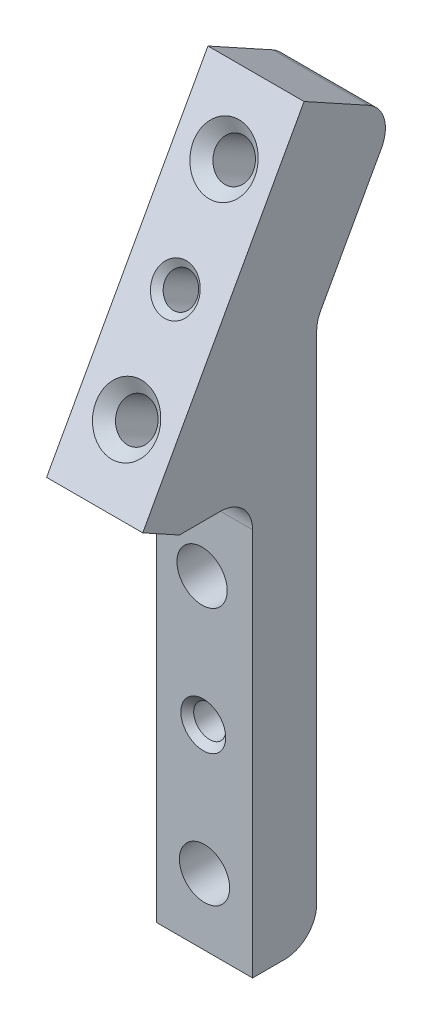
ISO-10303-21;
HEADER;
FILE_DESCRIPTION(('STEP AP214'),'2;1');
FILE_NAME('part.step','',(''),(''),'','','');
FILE_SCHEMA(('AUTOMOTIVE_DESIGN { 1 0 10303 214 1 1 1 1 }'));
ENDSEC;
DATA;
#1=APPLICATION_CONTEXT('core data for automotive mechanical design processes');
#2=APPLICATION_PROTOCOL_DEFINITION('international standard','automotive_design',2000,#1);
#3=PRODUCT_CONTEXT('',#1,'mechanical');
#4=PRODUCT('Part','Part','',(#3));
#5=PRODUCT_RELATED_PRODUCT_CATEGORY('part','',(#4));
#6=PRODUCT_DEFINITION_FORMATION('','',#4);
#7=PRODUCT_DEFINITION_CONTEXT('part definition',#1,'design');
#8=PRODUCT_DEFINITION('design','',#6,#7);
#9=PRODUCT_DEFINITION_SHAPE('','',#8);
#10=(LENGTH_UNIT() NAMED_UNIT(*) SI_UNIT(.MILLI.,.METRE.));
#11=(NAMED_UNIT(*) PLANE_ANGLE_UNIT() SI_UNIT($,.RADIAN.));
#12=(NAMED_UNIT(*) SI_UNIT($,.STERADIAN.) SOLID_ANGLE_UNIT());
#13=UNCERTAINTY_MEASURE_WITH_UNIT(LENGTH_MEASURE(1.E-05),#10,'distance_accuracy_value','');
#14=(GEOMETRIC_REPRESENTATION_CONTEXT(3) GLOBAL_UNCERTAINTY_ASSIGNED_CONTEXT((#13)) GLOBAL_UNIT_ASSIGNED_CONTEXT((#10,
#11,#12)) REPRESENTATION_CONTEXT('',''));
#15=CARTESIAN_POINT('',(0.,0.,0.));
#16=DIRECTION('',(0.,0.,1.));
#17=DIRECTION('',(1.,0.,0.));
#18=AXIS2_PLACEMENT_3D('',#15,#16,#17);
#19=CARTESIAN_POINT('',(9.525,-40.,6.34999999999999));
#20=DIRECTION('',(0.,0.,-1.));
#21=DIRECTION('',(-1.,0.,0.));
#22=AXIS2_PLACEMENT_3D('',#19,#20,#21);
#23=PLANE('',#22);
#24=DIRECTION('',(0.,-1.,0.));
#25=VECTOR('',#24,1.);
#26=CARTESIAN_POINT('',(9.525,-40.,6.34999999999999));
#27=LINE('',#26,#25);
#28=CARTESIAN_POINT('',(9.525,-1.54164341456056,6.34999999999999));
#29=VERTEX_POINT('',#28);
#30=CARTESIAN_POINT('',(9.525,-40.,6.34999999999999));
#31=VERTEX_POINT('',#30);
#32=EDGE_CURVE('E196',#29,#31,#27,.T.);
#33=ORIENTED_EDGE('',*,*,#32,.F.);
#34=DIRECTION('',(-1.,0.,0.));
#35=VECTOR('',#34,1.);
#36=CARTESIAN_POINT('',(9.525,-1.54164341456056,6.34999999999999));
#37=LINE('',#36,#35);
#38=CARTESIAN_POINT('',(0.,-1.54164341456056,6.34999999999999));
#39=VERTEX_POINT('',#38);
#40=EDGE_CURVE('E235',#29,#39,#37,.T.);
#41=ORIENTED_EDGE('',*,*,#40,.T.);
#42=DIRECTION('',(0.,-1.,0.));
#43=VECTOR('',#42,1.);
#44=CARTESIAN_POINT('',(0.,-40.,6.34999999999999));
#45=LINE('',#44,#43);
#46=CARTESIAN_POINT('',(0.,-40.,6.34999999999999));
#47=VERTEX_POINT('',#46);
#48=EDGE_CURVE('E206',#39,#47,#45,.T.);
#49=ORIENTED_EDGE('',*,*,#48,.T.);
#50=DIRECTION('',(-1.,0.,0.));
#51=VECTOR('',#50,1.);
#52=CARTESIAN_POINT('',(9.525,-40.,6.34999999999999));
#53=LINE('',#52,#51);
#54=EDGE_CURVE('E201',#31,#47,#53,.T.);
#55=ORIENTED_EDGE('',*,*,#54,.F.);
#56=EDGE_LOOP('',(#33,#41,#49,#55));
#57=FACE_BOUND('',#56,.T.);
#58=CARTESIAN_POINT('',(4.51976707861235,-8.01864341456056,6.35));
#59=DIRECTION('',(0.,0.,1.));
#60=DIRECTION('',(1.,0.,0.));
#61=AXIS2_PLACEMENT_3D('',#58,#59,#60);
#62=CIRCLE('',#61,2.48919999999999);
#63=CARTESIAN_POINT('',(7.00896707861233,-8.01864341456056,6.35));
#64=VERTEX_POINT('',#63);
#65=EDGE_CURVE('E568',#64,#64,#62,.T.);
#66=ORIENTED_EDGE('',*,*,#65,.F.);
#67=EDGE_LOOP('',(#66));
#68=FACE_BOUND('',#67,.T.);
#69=CARTESIAN_POINT('',(4.7625,-33.4186434145606,6.35));
#70=DIRECTION('',(0.,0.,1.));
#71=DIRECTION('',(1.,0.,0.));
#72=AXIS2_PLACEMENT_3D('',#69,#70,#71);
#73=CIRCLE('',#72,2.48919999999999);
#74=CARTESIAN_POINT('',(7.25169999999999,-33.4186434145606,6.35));
#75=VERTEX_POINT('',#74);
#76=EDGE_CURVE('E562',#75,#75,#73,.T.);
#77=ORIENTED_EDGE('',*,*,#76,.F.);
#78=EDGE_LOOP('',(#77));
#79=FACE_BOUND('',#78,.T.);
#80=CARTESIAN_POINT('',(4.64113353930617,-20.7186434145606,6.34999999999999));
#81=DIRECTION('',(0.,0.,1.));
#82=DIRECTION('',(1.,0.,0.));
#83=AXIS2_PLACEMENT_3D('',#80,#81,#82);
#84=CIRCLE('',#83,2.2225);
#85=CARTESIAN_POINT('',(6.86363353930617,-20.7186434145606,6.34999999999999));
#86=VERTEX_POINT('',#85);
#87=EDGE_CURVE('E551',#86,#86,#84,.T.);
#88=ORIENTED_EDGE('',*,*,#87,.F.);
#89=EDGE_LOOP('',(#88));
#90=FACE_BOUND('',#89,.T.);
#91=ADVANCED_FACE('F33',(#57,#68,#79,#90),#23,.F.);
#92=CARTESIAN_POINT('',(9.525,0.,0.));
#93=DIRECTION('',(0.,0.,1.));
#94=DIRECTION('',(0.,-1.,0.));
#95=AXIS2_PLACEMENT_3D('',#92,#93,#94);
#96=PLANE('',#95);
#97=CARTESIAN_POINT('',(4.64113353930617,-20.7186434145606,0.));
#98=DIRECTION('',(0.,0.,1.));
#99=DIRECTION('',(1.,0.,0.));
#100=AXIS2_PLACEMENT_3D('',#97,#98,#99);
#101=CIRCLE('',#100,2.2225);
#102=CARTESIAN_POINT('',(6.86363353930617,-20.7186434145606,0.));
#103=VERTEX_POINT('',#102);
#104=EDGE_CURVE('E553',#103,#103,#101,.T.);
#105=ORIENTED_EDGE('',*,*,#104,.T.);
#106=EDGE_LOOP('',(#105));
#107=FACE_BOUND('',#106,.T.);
#108=CARTESIAN_POINT('',(4.7625,-33.4186434145606,0.));
#109=DIRECTION('',(0.,0.,1.));
#110=DIRECTION('',(0.,-1.,0.));
#111=AXIS2_PLACEMENT_3D('',#108,#109,#110);
#112=CIRCLE('',#111,2.48919999999999);
#113=CARTESIAN_POINT('',(4.7625,-35.9078434145605,0.));
#114=VERTEX_POINT('',#113);
#115=EDGE_CURVE('E565',#114,#114,#112,.T.);
#116=ORIENTED_EDGE('',*,*,#115,.T.);
#117=EDGE_LOOP('',(#116));
#118=FACE_BOUND('',#117,.T.);
#119=CARTESIAN_POINT('',(4.51976707861235,-8.01864341456056,0.));
#120=DIRECTION('',(0.,0.,1.));
#121=DIRECTION('',(0.,-1.,0.));
#122=AXIS2_PLACEMENT_3D('',#119,#120,#121);
#123=CIRCLE('',#122,2.48919999999999);
#124=CARTESIAN_POINT('',(4.51976707861235,-10.5078434145606,0.));
#125=VERTEX_POINT('',#124);
#126=EDGE_CURVE('E571',#125,#125,#123,.T.);
#127=ORIENTED_EDGE('',*,*,#126,.T.);
#128=EDGE_LOOP('',(#127));
#129=FACE_BOUND('',#128,.T.);
#130=DIRECTION('',(0.,1.,0.));
#131=VECTOR('',#130,1.);
#132=CARTESIAN_POINT('',(9.525,0.,0.));
#133=LINE('',#132,#131);
#134=CARTESIAN_POINT('',(9.525,-36.825,0.));
#135=VERTEX_POINT('',#134);
#136=CARTESIAN_POINT('',(9.525,12.3434467278778,0.));
#137=VERTEX_POINT('',#136);
#138=EDGE_CURVE('E190',#135,#137,#133,.T.);
#139=ORIENTED_EDGE('',*,*,#138,.F.);
#140=DIRECTION('',(-1.,0.,0.));
#141=VECTOR('',#140,1.);
#142=CARTESIAN_POINT('',(9.525,-36.825,0.));
#143=LINE('',#142,#141);
#144=CARTESIAN_POINT('',(0.,-36.825,0.));
#145=VERTEX_POINT('',#144);
#146=EDGE_CURVE('E215',#135,#145,#143,.T.);
#147=ORIENTED_EDGE('',*,*,#146,.T.);
#148=DIRECTION('',(0.,1.,0.));
#149=VECTOR('',#148,1.);
#150=CARTESIAN_POINT('',(0.,0.,0.));
#151=LINE('',#150,#149);
#152=CARTESIAN_POINT('',(0.,12.3434467278778,0.));
#153=VERTEX_POINT('',#152);
#154=EDGE_CURVE('E189',#145,#153,#151,.T.);
#155=ORIENTED_EDGE('',*,*,#154,.T.);
#156=DIRECTION('',(1.,0.,0.));
#157=VECTOR('',#156,1.);
#158=CARTESIAN_POINT('',(9.525,12.3434467278778,0.));
#159=LINE('',#158,#157);
#160=EDGE_CURVE('E212',#153,#137,#159,.T.);
#161=ORIENTED_EDGE('',*,*,#160,.T.);
#162=EDGE_LOOP('',(#139,#147,#155,#161));
#163=FACE_BOUND('',#162,.T.);
#164=ADVANCED_FACE('F257',(#107,#118,#129,#163),#96,.F.);
#165=CARTESIAN_POINT('',(9.525,27.5887968857565,-7.94863424724493));
#166=DIRECTION('',(0.,-0.875885937034565,0.482518212407658));
#167=DIRECTION('',(0.,-0.482518212407658,-0.875885937034565));
#168=AXIS2_PLACEMENT_3D('',#165,#166,#167);
#169=PLANE('',#168);
#170=DIRECTION('',(0.,0.482518212407658,0.875885937034565));
#171=VECTOR('',#170,1.);
#172=CARTESIAN_POINT('',(9.525,27.5887968857565,-7.94863424724493));
#173=LINE('',#172,#171);
#174=CARTESIAN_POINT('',(9.525,29.1207922101508,-5.1676963971602));
#175=VERTEX_POINT('',#174);
#176=CARTESIAN_POINT('',(9.525,32.6552381160369,1.248168091618));
#177=VERTEX_POINT('',#176);
#178=EDGE_CURVE('E193',#175,#177,#173,.T.);
#179=ORIENTED_EDGE('',*,*,#178,.F.);
#180=DIRECTION('',(1.,0.,0.));
#181=VECTOR('',#180,1.);
#182=CARTESIAN_POINT('',(9.525,29.1207922101508,-5.1676963971602));
#183=LINE('',#182,#181);
#184=CARTESIAN_POINT('',(0.,29.1207922101508,-5.1676963971602));
#185=VERTEX_POINT('',#184);
#186=EDGE_CURVE('E233',#175,#185,#183,.F.);
#187=ORIENTED_EDGE('',*,*,#186,.T.);
#188=DIRECTION('',(0.,0.482518212407658,0.875885937034565));
#189=VECTOR('',#188,1.);
#190=CARTESIAN_POINT('',(0.,27.5887968857565,-7.94863424724493));
#191=LINE('',#190,#189);
#192=CARTESIAN_POINT('',(0.,32.6552381160369,1.248168091618));
#193=VERTEX_POINT('',#192);
#194=EDGE_CURVE('E204',#185,#193,#191,.T.);
#195=ORIENTED_EDGE('',*,*,#194,.T.);
#196=DIRECTION('',(-1.,0.,0.));
#197=VECTOR('',#196,1.);
#198=CARTESIAN_POINT('',(9.525,32.6552381160369,1.248168091618));
#199=LINE('',#198,#197);
#200=EDGE_CURVE('E172',#177,#193,#199,.T.);
#201=ORIENTED_EDGE('',*,*,#200,.F.);
#202=EDGE_LOOP('',(#179,#187,#195,#201));
#203=FACE_BOUND('',#202,.T.);
#204=ADVANCED_FACE('F291',(#203),#169,.F.);
#205=CARTESIAN_POINT('',(9.525,-40.,0.));
#206=DIRECTION('',(0.,1.,0.));
#207=DIRECTION('',(0.,0.,1.));
#208=AXIS2_PLACEMENT_3D('',#205,#206,#207);
#209=PLANE('',#208);
#210=DIRECTION('',(0.,0.,-1.));
#211=VECTOR('',#210,1.);
#212=CARTESIAN_POINT('',(0.,-40.,0.));
#213=LINE('',#212,#211);
#214=CARTESIAN_POINT('',(0.,-40.,3.17499999999999));
#215=VERTEX_POINT('',#214);
#216=EDGE_CURVE('E194',#47,#215,#213,.T.);
#217=ORIENTED_EDGE('',*,*,#216,.T.);
#218=DIRECTION('',(-1.,0.,0.));
#219=VECTOR('',#218,1.);
#220=CARTESIAN_POINT('',(9.525,-40.,3.17499999999999));
#221=LINE('',#220,#219);
#222=CARTESIAN_POINT('',(9.525,-40.,3.17499999999999));
#223=VERTEX_POINT('',#222);
#224=EDGE_CURVE('E222',#215,#223,#221,.F.);
#225=ORIENTED_EDGE('',*,*,#224,.T.);
#226=DIRECTION('',(0.,0.,-1.));
#227=VECTOR('',#226,1.);
#228=CARTESIAN_POINT('',(9.525,-40.,0.));
#229=LINE('',#228,#227);
#230=EDGE_CURVE('E198',#31,#223,#229,.T.);
#231=ORIENTED_EDGE('',*,*,#230,.F.);
#232=ORIENTED_EDGE('',*,*,#54,.T.);
#233=EDGE_LOOP('',(#217,#225,#231,#232));
#234=FACE_BOUND('',#233,.T.);
#235=ADVANCED_FACE('F266',(#234),#209,.F.);
#236=CARTESIAN_POINT('',(9.525,-40.,0.));
#237=DIRECTION('',(-1.,0.,0.));
#238=DIRECTION('',(0.,0.,1.));
#239=AXIS2_PLACEMENT_3D('',#236,#237,#238);
#240=PLANE('',#239);
#241=ORIENTED_EDGE('',*,*,#230,.T.);
#242=CARTESIAN_POINT('',(9.525,-36.825,3.17499999999999));
#243=DIRECTION('',(-1.,0.,0.));
#244=DIRECTION('',(0.,0.,1.));
#245=AXIS2_PLACEMENT_3D('',#242,#243,#244);
#246=CIRCLE('',#245,3.175);
#247=EDGE_CURVE('E226',#223,#135,#246,.F.);
#248=ORIENTED_EDGE('',*,*,#247,.T.);
#249=ORIENTED_EDGE('',*,*,#138,.T.);
#250=CARTESIAN_POINT('',(9.525,12.3434467278778,-3.175));
#251=DIRECTION('',(-1.,0.,0.));
#252=DIRECTION('',(0.,0.,1.));
#253=AXIS2_PLACEMENT_3D('',#250,#251,#252);
#254=CIRCLE('',#253,3.175);
#255=CARTESIAN_POINT('',(9.525,13.8754420522721,-0.394062149915255));
#256=VERTEX_POINT('',#255);
#257=EDGE_CURVE('E42',#137,#256,#254,.T.);
#258=ORIENTED_EDGE('',*,*,#257,.T.);
#259=DIRECTION('',(0.,-0.875885937034565,0.482518212407659));
#260=VECTOR('',#259,1.);
#261=CARTESIAN_POINT('',(9.525,27.5887968857564,-7.94863424724495));
#262=LINE('',#261,#260);
#263=CARTESIAN_POINT('',(9.525,24.8078590356717,-6.41663892285062));
#264=VERTEX_POINT('',#263);
#265=EDGE_CURVE('E160',#264,#256,#262,.T.);
#266=ORIENTED_EDGE('',*,*,#265,.F.);
#267=CARTESIAN_POINT('',(9.525,26.339854360066,-3.63570107276588));
#268=DIRECTION('',(-1.,0.,0.));
#269=DIRECTION('',(0.,0.,1.));
#270=AXIS2_PLACEMENT_3D('',#267,#268,#269);
#271=CIRCLE('',#270,3.175);
#272=EDGE_CURVE('E224',#264,#175,#271,.F.);
#273=ORIENTED_EDGE('',*,*,#272,.T.);
#274=ORIENTED_EDGE('',*,*,#178,.T.);
#275=DIRECTION('',(0.,0.875885937034565,-0.482518212407658));
#276=VECTOR('',#275,1.);
#277=CARTESIAN_POINT('',(9.525,6.69979781571985,15.5468023388629));
#278=LINE('',#277,#276);
#279=CARTESIAN_POINT('',(9.525,3.63580716693122,17.2347290747262));
#280=VERTEX_POINT('',#279);
#281=EDGE_CURVE('E186',#280,#177,#278,.T.);
#282=ORIENTED_EDGE('',*,*,#281,.F.);
#283=DIRECTION('',(0.,-0.482518212407658,-0.875885937034565));
#284=VECTOR('',#283,1.);
#285=CARTESIAN_POINT('',(9.525,3.63580716693122,17.2347290747262));
#286=LINE('',#285,#284);
#287=CARTESIAN_POINT('',(9.525,1.63335658543944,13.5998024360327));
#288=VERTEX_POINT('',#287);
#289=EDGE_CURVE('E169',#280,#288,#286,.T.);
#290=ORIENTED_EDGE('',*,*,#289,.T.);
#291=DIRECTION('',(0.,0.,-1.));
#292=VECTOR('',#291,1.);
#293=CARTESIAN_POINT('',(9.525,1.63335658543944,6.34999999999999));
#294=LINE('',#293,#292);
#295=CARTESIAN_POINT('',(9.525,1.63335658543944,9.52499999999999));
#296=VERTEX_POINT('',#295);
#297=EDGE_CURVE('E167',#288,#296,#294,.T.);
#298=ORIENTED_EDGE('',*,*,#297,.T.);
#299=CARTESIAN_POINT('',(9.525,-1.54164341456056,9.52499999999999));
#300=DIRECTION('',(-1.,0.,0.));
#301=DIRECTION('',(0.,0.,1.));
#302=AXIS2_PLACEMENT_3D('',#299,#300,#301);
#303=CIRCLE('',#302,3.175);
#304=EDGE_CURVE('E49',#296,#29,#303,.T.);
#305=ORIENTED_EDGE('',*,*,#304,.T.);
#306=ORIENTED_EDGE('',*,*,#32,.T.);
#307=EDGE_LOOP('',(#241,#248,#249,#258,#266,#273,#274,#282,#290,#298,#305,#306));
#308=FACE_BOUND('',#307,.T.);
#309=ADVANCED_FACE('F243',(#308),#240,.F.);
#310=CARTESIAN_POINT('',(0.,-40.,0.));
#311=DIRECTION('',(-1.,0.,0.));
#312=DIRECTION('',(0.,0.,1.));
#313=AXIS2_PLACEMENT_3D('',#310,#311,#312);
#314=PLANE('',#313);
#315=ORIENTED_EDGE('',*,*,#154,.F.);
#316=CARTESIAN_POINT('',(0.,-36.825,3.17499999999999));
#317=DIRECTION('',(-1.,0.,0.));
#318=DIRECTION('',(0.,0.,1.));
#319=AXIS2_PLACEMENT_3D('',#316,#317,#318);
#320=CIRCLE('',#319,3.175);
#321=EDGE_CURVE('E220',#145,#215,#320,.T.);
#322=ORIENTED_EDGE('',*,*,#321,.T.);
#323=ORIENTED_EDGE('',*,*,#216,.F.);
#324=ORIENTED_EDGE('',*,*,#48,.F.);
#325=CARTESIAN_POINT('',(0.,-1.54164341456056,9.52499999999999));
#326=DIRECTION('',(-1.,0.,0.));
#327=DIRECTION('',(0.,0.,1.));
#328=AXIS2_PLACEMENT_3D('',#325,#326,#327);
#329=CIRCLE('',#328,3.175);
#330=CARTESIAN_POINT('',(0.,1.63335658543944,9.52499999999999));
#331=VERTEX_POINT('',#330);
#332=EDGE_CURVE('E239',#39,#331,#329,.F.);
#333=ORIENTED_EDGE('',*,*,#332,.T.);
#334=DIRECTION('',(0.,0.,1.));
#335=VECTOR('',#334,1.);
#336=CARTESIAN_POINT('',(0.,1.63335658543944,6.34999999999999));
#337=LINE('',#336,#335);
#338=CARTESIAN_POINT('',(0.,1.63335658543944,13.5998024360327));
#339=VERTEX_POINT('',#338);
#340=EDGE_CURVE('E166',#331,#339,#337,.T.);
#341=ORIENTED_EDGE('',*,*,#340,.T.);
#342=DIRECTION('',(0.,0.482518212407658,0.875885937034565));
#343=VECTOR('',#342,1.);
#344=CARTESIAN_POINT('',(0.,3.63580716693122,17.2347290747262));
#345=LINE('',#344,#343);
#346=CARTESIAN_POINT('',(0.,3.63580716693122,17.2347290747262));
#347=VERTEX_POINT('',#346);
#348=EDGE_CURVE('E174',#339,#347,#345,.T.);
#349=ORIENTED_EDGE('',*,*,#348,.T.);
#350=DIRECTION('',(0.,-0.875885937034565,0.482518212407658));
#351=VECTOR('',#350,1.);
#352=CARTESIAN_POINT('',(0.,32.6552381160369,1.248168091618));
#353=LINE('',#352,#351);
#354=EDGE_CURVE('E184',#193,#347,#353,.T.);
#355=ORIENTED_EDGE('',*,*,#354,.F.);
#356=ORIENTED_EDGE('',*,*,#194,.F.);
#357=CARTESIAN_POINT('',(0.,26.339854360066,-3.63570107276588));
#358=DIRECTION('',(-1.,0.,0.));
#359=DIRECTION('',(0.,0.,1.));
#360=AXIS2_PLACEMENT_3D('',#357,#358,#359);
#361=CIRCLE('',#360,3.175);
#362=CARTESIAN_POINT('',(0.,24.8078590356717,-6.41663892285062));
#363=VERTEX_POINT('',#362);
#364=EDGE_CURVE('E218',#185,#363,#361,.T.);
#365=ORIENTED_EDGE('',*,*,#364,.T.);
#366=DIRECTION('',(0.,-0.875885937034565,0.482518212407659));
#367=VECTOR('',#366,1.);
#368=CARTESIAN_POINT('',(0.,27.5887968857564,-7.94863424724495));
#369=LINE('',#368,#367);
#370=CARTESIAN_POINT('',(0.,13.8754420522721,-0.394062149915255));
#371=VERTEX_POINT('',#370);
#372=EDGE_CURVE('E163',#363,#371,#369,.T.);
#373=ORIENTED_EDGE('',*,*,#372,.T.);
#374=CARTESIAN_POINT('',(0.,12.3434467278778,-3.175));
#375=DIRECTION('',(-1.,0.,0.));
#376=DIRECTION('',(0.,0.,1.));
#377=AXIS2_PLACEMENT_3D('',#374,#375,#376);
#378=CIRCLE('',#377,3.175);
#379=EDGE_CURVE('E11',#371,#153,#378,.F.);
#380=ORIENTED_EDGE('',*,*,#379,.T.);
#381=EDGE_LOOP('',(#315,#322,#323,#324,#333,#341,#349,#355,#356,#365,#373,#380));
#382=FACE_BOUND('',#381,.T.);
#383=ADVANCED_FACE('F255',(#382),#314,.T.);
#384=CARTESIAN_POINT('',(0.,32.6552381160369,1.248168091618));
#385=DIRECTION('',(0.,0.482518212407658,0.875885937034565));
#386=DIRECTION('',(0.,-0.875885937034565,0.482518212407658));
#387=AXIS2_PLACEMENT_3D('',#384,#385,#386);
#388=PLANE('',#387);
#389=CARTESIAN_POINT('',(4.7625,18.1455226414841,9.24144858317209));
#390=DIRECTION('',(0.,0.482518212407658,0.875885937034565));
#391=DIRECTION('',(0.,-0.875885937034565,0.482518212407658));
#392=AXIS2_PLACEMENT_3D('',#389,#390,#391);
#393=CIRCLE('',#392,2.2225);
#394=CARTESIAN_POINT('',(4.7625,16.1988661464247,10.3138453102481));
#395=VERTEX_POINT('',#394);
#396=EDGE_CURVE('E145',#395,#395,#393,.T.);
#397=ORIENTED_EDGE('',*,*,#396,.F.);
#398=EDGE_LOOP('',(#397));
#399=FACE_BOUND('',#398,.T.);
#400=CARTESIAN_POINT('',(4.7625,26.9043820118297,4.41626645909551));
#401=DIRECTION('',(0.,0.482518212407658,0.875885937034565));
#402=DIRECTION('',(0.,-0.875885937034565,0.482518212407658));
#403=AXIS2_PLACEMENT_3D('',#400,#401,#402);
#404=CIRCLE('',#403,3.048);
#405=CARTESIAN_POINT('',(4.7625,24.2346816757484,5.88698197051405));
#406=VERTEX_POINT('',#405);
#407=EDGE_CURVE('E138',#406,#406,#404,.T.);
#408=ORIENTED_EDGE('',*,*,#407,.F.);
#409=EDGE_LOOP('',(#408));
#410=FACE_BOUND('',#409,.T.);
#411=CARTESIAN_POINT('',(4.7625,9.3866632711384,14.0666307072487));
#412=DIRECTION('',(0.,0.482518212407658,0.875885937034565));
#413=DIRECTION('',(0.,-0.875885937034565,0.482518212407658));
#414=AXIS2_PLACEMENT_3D('',#411,#412,#413);
#415=CIRCLE('',#414,3.048);
#416=CARTESIAN_POINT('',(4.7625,6.71696293505705,15.5373462186672));
#417=VERTEX_POINT('',#416);
#418=EDGE_CURVE('E151',#417,#417,#415,.T.);
#419=ORIENTED_EDGE('',*,*,#418,.F.);
#420=EDGE_LOOP('',(#419));
#421=FACE_BOUND('',#420,.T.);
#422=ORIENTED_EDGE('',*,*,#200,.T.);
#423=ORIENTED_EDGE('',*,*,#354,.T.);
#424=DIRECTION('',(-1.,0.,0.));
#425=VECTOR('',#424,1.);
#426=CARTESIAN_POINT('',(21.5310881959977,3.63580716693122,17.2347290747262));
#427=LINE('',#426,#425);
#428=EDGE_CURVE('E170',#280,#347,#427,.T.);
#429=ORIENTED_EDGE('',*,*,#428,.F.);
#430=ORIENTED_EDGE('',*,*,#281,.T.);
#431=EDGE_LOOP('',(#422,#423,#429,#430));
#432=FACE_BOUND('',#431,.T.);
#433=ADVANCED_FACE('F316',(#399,#410,#421,#432),#388,.T.);
#434=CARTESIAN_POINT('',(21.5310881959977,3.63580716693122,17.2347290747262));
#435=DIRECTION('',(0.,-0.875885937034565,0.482518212407658));
#436=DIRECTION('',(0.,-0.482518212407658,-0.875885937034565));
#437=AXIS2_PLACEMENT_3D('',#434,#435,#436);
#438=PLANE('',#437);
#439=ORIENTED_EDGE('',*,*,#289,.F.);
#440=ORIENTED_EDGE('',*,*,#428,.T.);
#441=ORIENTED_EDGE('',*,*,#348,.F.);
#442=DIRECTION('',(-1.,0.,0.));
#443=VECTOR('',#442,1.);
#444=CARTESIAN_POINT('',(21.5310881959977,1.63335658543944,13.5998024360327));
#445=LINE('',#444,#443);
#446=EDGE_CURVE('E177',#288,#339,#445,.T.);
#447=ORIENTED_EDGE('',*,*,#446,.F.);
#448=EDGE_LOOP('',(#439,#440,#441,#447));
#449=FACE_BOUND('',#448,.T.);
#450=ADVANCED_FACE('F309',(#449),#438,.T.);
#451=CARTESIAN_POINT('',(21.5310881959977,1.63335658543944,6.34999999999999));
#452=DIRECTION('',(0.,-1.,0.));
#453=DIRECTION('',(0.,0.,-1.));
#454=AXIS2_PLACEMENT_3D('',#451,#452,#453);
#455=PLANE('',#454);
#456=ORIENTED_EDGE('',*,*,#340,.F.);
#457=DIRECTION('',(-1.,0.,0.));
#458=VECTOR('',#457,1.);
#459=CARTESIAN_POINT('',(21.5310881959977,1.63335658543944,9.52499999999999));
#460=LINE('',#459,#458);
#461=EDGE_CURVE('E57',#331,#296,#460,.F.);
#462=ORIENTED_EDGE('',*,*,#461,.T.);
#463=ORIENTED_EDGE('',*,*,#297,.F.);
#464=ORIENTED_EDGE('',*,*,#446,.T.);
#465=EDGE_LOOP('',(#456,#462,#463,#464));
#466=FACE_BOUND('',#465,.T.);
#467=ADVANCED_FACE('F273',(#466),#455,.T.);
#468=CARTESIAN_POINT('',(-30.7193032577679,27.5887968857564,-7.94863424724495));
#469=DIRECTION('',(0.,0.482518212407659,0.875885937034565));
#470=DIRECTION('',(0.,-0.875885937034565,0.482518212407659));
#471=AXIS2_PLACEMENT_3D('',#468,#469,#470);
#472=PLANE('',#471);
#473=CARTESIAN_POINT('',(4.7625,21.8379407815493,-4.78053587976744));
#474=DIRECTION('',(0.,0.482518212407659,0.875885937034565));
#475=DIRECTION('',(0.,-0.875885937034565,0.482518212407659));
#476=AXIS2_PLACEMENT_3D('',#473,#474,#475);
#477=CIRCLE('',#476,1.89865);
#478=CARTESIAN_POINT('',(4.7625,20.1749399471986,-3.86440267577964));
#479=VERTEX_POINT('',#478);
#480=EDGE_CURVE('E37',#479,#479,#477,.T.);
#481=ORIENTED_EDGE('',*,*,#480,.T.);
#482=EDGE_LOOP('',(#481));
#483=FACE_BOUND('',#482,.T.);
#484=ORIENTED_EDGE('',*,*,#372,.F.);
#485=DIRECTION('',(1.,0.,0.));
#486=VECTOR('',#485,1.);
#487=CARTESIAN_POINT('',(-30.7193032577679,24.8078590356717,-6.41663892285062));
#488=LINE('',#487,#486);
#489=EDGE_CURVE('E230',#363,#264,#488,.T.);
#490=ORIENTED_EDGE('',*,*,#489,.T.);
#491=ORIENTED_EDGE('',*,*,#265,.T.);
#492=DIRECTION('',(1.,0.,0.));
#493=VECTOR('',#492,1.);
#494=CARTESIAN_POINT('',(0.,13.8754420522721,-0.394062149915255));
#495=LINE('',#494,#493);
#496=EDGE_CURVE('E228',#256,#371,#495,.F.);
#497=ORIENTED_EDGE('',*,*,#496,.T.);
#498=EDGE_LOOP('',(#484,#490,#491,#497));
#499=FACE_BOUND('',#498,.T.);
#500=ADVANCED_FACE('F250',(#483,#499),#472,.F.);
#501=CARTESIAN_POINT('',(9.525,-36.825,3.17499999999999));
#502=DIRECTION('',(-1.,0.,0.));
#503=DIRECTION('',(0.,0.,1.));
#504=AXIS2_PLACEMENT_3D('',#501,#502,#503);
#505=CYLINDRICAL_SURFACE('',#504,3.175);
#506=ORIENTED_EDGE('',*,*,#247,.F.);
#507=ORIENTED_EDGE('',*,*,#224,.F.);
#508=ORIENTED_EDGE('',*,*,#321,.F.);
#509=ORIENTED_EDGE('',*,*,#146,.F.);
#510=EDGE_LOOP('',(#506,#507,#508,#509));
#511=FACE_BOUND('',#510,.T.);
#512=ADVANCED_FACE('F261',(#511),#505,.T.);
#513=CARTESIAN_POINT('',(-30.7193032577679,26.339854360066,-3.63570107276588));
#514=DIRECTION('',(1.,0.,0.));
#515=DIRECTION('',(0.,0.,-1.));
#516=AXIS2_PLACEMENT_3D('',#513,#514,#515);
#517=CYLINDRICAL_SURFACE('',#516,3.175);
#518=ORIENTED_EDGE('',*,*,#364,.F.);
#519=ORIENTED_EDGE('',*,*,#186,.F.);
#520=ORIENTED_EDGE('',*,*,#272,.F.);
#521=ORIENTED_EDGE('',*,*,#489,.F.);
#522=EDGE_LOOP('',(#518,#519,#520,#521));
#523=FACE_BOUND('',#522,.T.);
#524=ADVANCED_FACE('F278',(#523),#517,.T.);
#525=CARTESIAN_POINT('',(9.525,-1.54164341456056,9.52499999999999));
#526=DIRECTION('',(-1.,0.,0.));
#527=DIRECTION('',(0.,0.,1.));
#528=AXIS2_PLACEMENT_3D('',#525,#526,#527);
#529=CYLINDRICAL_SURFACE('',#528,3.175);
#530=ORIENTED_EDGE('',*,*,#304,.F.);
#531=ORIENTED_EDGE('',*,*,#461,.F.);
#532=ORIENTED_EDGE('',*,*,#332,.F.);
#533=ORIENTED_EDGE('',*,*,#40,.F.);
#534=EDGE_LOOP('',(#530,#531,#532,#533));
#535=FACE_BOUND('',#534,.T.);
#536=ADVANCED_FACE('F276',(#535),#529,.F.);
#537=CARTESIAN_POINT('',(9.525,12.3434467278778,-3.175));
#538=DIRECTION('',(-1.,0.,0.));
#539=DIRECTION('',(0.,0.,1.));
#540=AXIS2_PLACEMENT_3D('',#537,#538,#539);
#541=CYLINDRICAL_SURFACE('',#540,3.175);
#542=ORIENTED_EDGE('',*,*,#379,.F.);
#543=ORIENTED_EDGE('',*,*,#496,.F.);
#544=ORIENTED_EDGE('',*,*,#257,.F.);
#545=ORIENTED_EDGE('',*,*,#160,.F.);
#546=EDGE_LOOP('',(#542,#543,#544,#545));
#547=FACE_BOUND('',#546,.T.);
#548=ADVANCED_FACE('F35',(#547),#541,.F.);
#549=CARTESIAN_POINT('',(4.7625,3.19595460594815,2.82901413509519));
#550=DIRECTION('',(0.,0.482518212407658,0.875885937034565));
#551=DIRECTION('',(0.,-0.875885937034565,0.482518212407658));
#552=AXIS2_PLACEMENT_3D('',#549,#550,#551);
#553=CONICAL_SURFACE('',#552,1.89865,1.02974425867665);
#554=CARTESIAN_POINT('',(4.7625,2.64548624188834,1.8297824243239));
#555=VERTEX_POINT('',#554);
#556=VERTEX_LOOP('',#555);
#557=FACE_BOUND('',#556,.T.);
#558=CARTESIAN_POINT('',(4.7625,3.19595460594815,2.82901413509519));
#559=DIRECTION('',(0.,0.482518212407658,0.875885937034565));
#560=DIRECTION('',(0.,-0.875885937034565,0.482518212407658));
#561=AXIS2_PLACEMENT_3D('',#558,#559,#560);
#562=CIRCLE('',#561,1.89865);
#563=CARTESIAN_POINT('',(4.7625,1.53295377159747,3.74514733908299));
#564=VERTEX_POINT('',#563);
#565=EDGE_CURVE('E157',#564,#564,#562,.T.);
#566=ORIENTED_EDGE('',*,*,#565,.T.);
#567=EDGE_LOOP('',(#566));
#568=FACE_BOUND('',#567,.T.);
#569=ADVANCED_FACE('F283',(#557,#568),#553,.F.);
#570=CARTESIAN_POINT('',(4.7625,9.3866632711384,14.0666307072487));
#571=DIRECTION('',(0.,0.482518212407658,0.875885937034565));
#572=DIRECTION('',(0.,-0.875885937034565,0.482518212407658));
#573=AXIS2_PLACEMENT_3D('',#570,#571,#572);
#574=CYLINDRICAL_SURFACE('',#573,1.89865);
#575=ORIENTED_EDGE('',*,*,#565,.F.);
#576=EDGE_LOOP('',(#575));
#577=FACE_BOUND('',#576,.T.);
#578=CARTESIAN_POINT('',(4.7625,8.83208096370766,13.059931205518));
#579=DIRECTION('',(0.,0.482518212407658,0.875885937034565));
#580=DIRECTION('',(0.,-0.875885937034565,0.482518212407658));
#581=AXIS2_PLACEMENT_3D('',#578,#579,#580);
#582=CIRCLE('',#581,1.89865);
#583=CARTESIAN_POINT('',(4.7625,7.16908012935698,13.9760644095058));
#584=VERTEX_POINT('',#583);
#585=EDGE_CURVE('E154',#584,#584,#582,.T.);
#586=ORIENTED_EDGE('',*,*,#585,.T.);
#587=EDGE_LOOP('',(#586));
#588=FACE_BOUND('',#587,.T.);
#589=ADVANCED_FACE('F378',(#577,#588),#574,.F.);
#590=CARTESIAN_POINT('',(4.7625,9.3866632711384,14.0666307072487));
#591=DIRECTION('',(0.,0.482518212407658,0.875885937034565));
#592=DIRECTION('',(0.,-0.875885937034565,0.482518212407658));
#593=AXIS2_PLACEMENT_3D('',#590,#591,#592);
#594=CONICAL_SURFACE('',#593,3.048,0.78539816339745);
#595=ORIENTED_EDGE('',*,*,#585,.F.);
#596=EDGE_LOOP('',(#595));
#597=FACE_BOUND('',#596,.T.);
#598=ORIENTED_EDGE('',*,*,#418,.T.);
#599=EDGE_LOOP('',(#598));
#600=FACE_BOUND('',#599,.T.);
#601=ADVANCED_FACE('F388',(#597,#600),#594,.F.);
#602=CARTESIAN_POINT('',(4.7625,26.9043820118297,4.41626645909551));
#603=DIRECTION('',(0.,0.482518212407658,0.875885937034565));
#604=DIRECTION('',(0.,-0.875885937034565,0.482518212407658));
#605=AXIS2_PLACEMENT_3D('',#602,#603,#604);
#606=CYLINDRICAL_SURFACE('',#605,1.89865);
#607=CARTESIAN_POINT('',(4.7625,26.349799704399,3.40956695736483));
#608=DIRECTION('',(0.,0.482518212407658,0.875885937034565));
#609=DIRECTION('',(0.,-0.875885937034565,0.482518212407658));
#610=AXIS2_PLACEMENT_3D('',#607,#608,#609);
#611=CIRCLE('',#610,1.89865);
#612=CARTESIAN_POINT('',(4.7625,24.6867988700483,4.32570016135263));
#613=VERTEX_POINT('',#612);
#614=EDGE_CURVE('E142',#613,#613,#611,.T.);
#615=ORIENTED_EDGE('',*,*,#614,.T.);
#616=EDGE_LOOP('',(#615));
#617=FACE_BOUND('',#616,.T.);
#618=ORIENTED_EDGE('',*,*,#480,.F.);
#619=EDGE_LOOP('',(#618));
#620=FACE_BOUND('',#619,.T.);
#621=ADVANCED_FACE('F398',(#617,#620),#606,.F.);
#622=CARTESIAN_POINT('',(4.7625,26.9043820118297,4.41626645909551));
#623=DIRECTION('',(0.,0.482518212407658,0.875885937034565));
#624=DIRECTION('',(0.,-0.875885937034565,0.482518212407658));
#625=AXIS2_PLACEMENT_3D('',#622,#623,#624);
#626=CONICAL_SURFACE('',#625,3.048,0.78539816339745);
#627=ORIENTED_EDGE('',*,*,#614,.F.);
#628=EDGE_LOOP('',(#627));
#629=FACE_BOUND('',#628,.T.);
#630=ORIENTED_EDGE('',*,*,#407,.T.);
#631=EDGE_LOOP('',(#630));
#632=FACE_BOUND('',#631,.T.);
#633=ADVANCED_FACE('F132',(#629,#632),#626,.F.);
#634=CARTESIAN_POINT('',(4.7625,14.2853769422228,2.23436108689557));
#635=DIRECTION('',(0.,0.482518212407658,0.875885937034565));
#636=DIRECTION('',(0.,-0.875885937034565,0.482518212407658));
#637=AXIS2_PLACEMENT_3D('',#634,#635,#636);
#638=CONICAL_SURFACE('',#637,1.5875,1.02974425867665);
#639=CARTESIAN_POINT('',(4.7625,13.8251191127413,1.39888306785602));
#640=VERTEX_POINT('',#639);
#641=VERTEX_LOOP('',#640);
#642=FACE_BOUND('',#641,.T.);
#643=CARTESIAN_POINT('',(4.7625,14.2853769422228,2.23436108689557));
#644=DIRECTION('',(0.,0.482518212407658,0.875885937034565));
#645=DIRECTION('',(0.,-0.875885937034565,0.482518212407658));
#646=AXIS2_PLACEMENT_3D('',#643,#644,#645);
#647=CIRCLE('',#646,1.5875);
#648=CARTESIAN_POINT('',(4.7625,12.8949080171804,3.00035874909272));
#649=VERTEX_POINT('',#648);
#650=EDGE_CURVE('E136',#649,#649,#647,.T.);
#651=ORIENTED_EDGE('',*,*,#650,.T.);
#652=EDGE_LOOP('',(#651));
#653=FACE_BOUND('',#652,.T.);
#654=ADVANCED_FACE('F128',(#642,#653),#638,.F.);
#655=CARTESIAN_POINT('',(4.7625,18.1455226414841,9.24144858317209));
#656=DIRECTION('',(0.,0.482518212407658,0.875885937034565));
#657=DIRECTION('',(0.,-0.875885937034565,0.482518212407658));
#658=AXIS2_PLACEMENT_3D('',#655,#656,#657);
#659=CYLINDRICAL_SURFACE('',#658,1.5875);
#660=ORIENTED_EDGE('',*,*,#650,.F.);
#661=EDGE_LOOP('',(#660));
#662=FACE_BOUND('',#661,.T.);
#663=CARTESIAN_POINT('',(4.7625,17.8391235766052,8.68526101315514));
#664=DIRECTION('',(0.,0.482518212407658,0.875885937034565));
#665=DIRECTION('',(0.,-0.875885937034565,0.482518212407658));
#666=AXIS2_PLACEMENT_3D('',#663,#664,#665);
#667=CIRCLE('',#666,1.5875);
#668=CARTESIAN_POINT('',(4.7625,16.4486546515628,9.4512586753523));
#669=VERTEX_POINT('',#668);
#670=EDGE_CURVE('E139',#669,#669,#667,.T.);
#671=ORIENTED_EDGE('',*,*,#670,.T.);
#672=EDGE_LOOP('',(#671));
#673=FACE_BOUND('',#672,.T.);
#674=ADVANCED_FACE('F131',(#662,#673),#659,.F.);
#675=CARTESIAN_POINT('',(4.7625,18.1455226414841,9.24144858317209));
#676=DIRECTION('',(0.,0.482518212407658,0.875885937034565));
#677=DIRECTION('',(0.,-0.875885937034565,0.482518212407658));
#678=AXIS2_PLACEMENT_3D('',#675,#676,#677);
#679=CONICAL_SURFACE('',#678,2.2225,0.785398163397447);
#680=ORIENTED_EDGE('',*,*,#670,.F.);
#681=EDGE_LOOP('',(#680));
#682=FACE_BOUND('',#681,.T.);
#683=ORIENTED_EDGE('',*,*,#396,.T.);
#684=EDGE_LOOP('',(#683));
#685=FACE_BOUND('',#684,.T.);
#686=ADVANCED_FACE('F428',(#682,#685),#679,.F.);
#687=CARTESIAN_POINT('',(4.51976707861235,-8.01864341456056,6.34999999999999));
#688=DIRECTION('',(0.,0.,1.));
#689=DIRECTION('',(1.,0.,0.));
#690=AXIS2_PLACEMENT_3D('',#687,#688,#689);
#691=CYLINDRICAL_SURFACE('',#690,2.48919999999999);
#692=ORIENTED_EDGE('',*,*,#65,.T.);
#693=EDGE_LOOP('',(#692));
#694=FACE_BOUND('',#693,.T.);
#695=ORIENTED_EDGE('',*,*,#126,.F.);
#696=EDGE_LOOP('',(#695));
#697=FACE_BOUND('',#696,.T.);
#698=ADVANCED_FACE('F435',(#694,#697),#691,.F.);
#699=CARTESIAN_POINT('',(4.7625,-33.4186434145606,6.34999999999999));
#700=DIRECTION('',(0.,0.,1.));
#701=DIRECTION('',(1.,0.,0.));
#702=AXIS2_PLACEMENT_3D('',#699,#700,#701);
#703=CYLINDRICAL_SURFACE('',#702,2.48919999999999);
#704=ORIENTED_EDGE('',*,*,#76,.T.);
#705=EDGE_LOOP('',(#704));
#706=FACE_BOUND('',#705,.T.);
#707=ORIENTED_EDGE('',*,*,#115,.F.);
#708=EDGE_LOOP('',(#707));
#709=FACE_BOUND('',#708,.T.);
#710=ADVANCED_FACE('F443',(#706,#709),#703,.F.);
#711=CARTESIAN_POINT('',(4.64113353930617,-20.7186434145606,0.634999999999997));
#712=DIRECTION('',(0.,0.,-1.));
#713=DIRECTION('',(-1.,0.,0.));
#714=AXIS2_PLACEMENT_3D('',#711,#712,#713);
#715=CONICAL_SURFACE('',#714,1.5875,0.78539816339745);
#716=ORIENTED_EDGE('',*,*,#104,.F.);
#717=EDGE_LOOP('',(#716));
#718=FACE_BOUND('',#717,.T.);
#719=CARTESIAN_POINT('',(4.64113353930617,-20.7186434145606,0.634999999999997));
#720=DIRECTION('',(0.,0.,1.));
#721=DIRECTION('',(1.,0.,0.));
#722=AXIS2_PLACEMENT_3D('',#719,#720,#721);
#723=CIRCLE('',#722,1.5875);
#724=CARTESIAN_POINT('',(6.22863353930617,-20.7186434145606,0.634999999999997));
#725=VERTEX_POINT('',#724);
#726=EDGE_CURVE('E555',#725,#725,#723,.T.);
#727=ORIENTED_EDGE('',*,*,#726,.T.);
#728=EDGE_LOOP('',(#727));
#729=FACE_BOUND('',#728,.T.);
#730=ADVANCED_FACE('F451',(#718,#729),#715,.F.);
#731=CARTESIAN_POINT('',(4.64113353930617,-20.7186434145606,6.34999999999999));
#732=DIRECTION('',(0.,0.,1.));
#733=DIRECTION('',(1.,0.,0.));
#734=AXIS2_PLACEMENT_3D('',#731,#732,#733);
#735=CYLINDRICAL_SURFACE('',#734,1.5875);
#736=ORIENTED_EDGE('',*,*,#726,.F.);
#737=EDGE_LOOP('',(#736));
#738=FACE_BOUND('',#737,.T.);
#739=CARTESIAN_POINT('',(4.64113353930617,-20.7186434145606,5.71499999999999));
#740=DIRECTION('',(0.,0.,1.));
#741=DIRECTION('',(1.,0.,0.));
#742=AXIS2_PLACEMENT_3D('',#739,#740,#741);
#743=CIRCLE('',#742,1.5875);
#744=CARTESIAN_POINT('',(6.22863353930617,-20.7186434145606,5.71499999999999));
#745=VERTEX_POINT('',#744);
#746=EDGE_CURVE('E548',#745,#745,#743,.T.);
#747=ORIENTED_EDGE('',*,*,#746,.T.);
#748=EDGE_LOOP('',(#747));
#749=FACE_BOUND('',#748,.T.);
#750=ADVANCED_FACE('F459',(#738,#749),#735,.F.);
#751=CARTESIAN_POINT('',(4.64113353930617,-20.7186434145606,6.34999999999999));
#752=DIRECTION('',(0.,0.,1.));
#753=DIRECTION('',(1.,0.,0.));
#754=AXIS2_PLACEMENT_3D('',#751,#752,#753);
#755=CONICAL_SURFACE('',#754,2.2225,0.785398163397448);
#756=ORIENTED_EDGE('',*,*,#746,.F.);
#757=EDGE_LOOP('',(#756));
#758=FACE_BOUND('',#757,.T.);
#759=ORIENTED_EDGE('',*,*,#87,.T.);
#760=EDGE_LOOP('',(#759));
#761=FACE_BOUND('',#760,.T.);
#762=ADVANCED_FACE('F468',(#758,#761),#755,.F.);
#763=CLOSED_SHELL('',(#91,#164,#204,#235,#309,#383,#433,#450,#467,#500,#512,#524,#536,#548,#569,
#589,#601,#621,#633,#654,#674,#686,#698,#710,#730,#750,#762));
#764=MANIFOLD_SOLID_BREP('B2',#763);
#765=ADVANCED_BREP_SHAPE_REPRESENTATION('',(#18,#764),#14);
#766=SHAPE_DEFINITION_REPRESENTATION(#9,#765);
ENDSEC;
END-ISO-10303-21;
